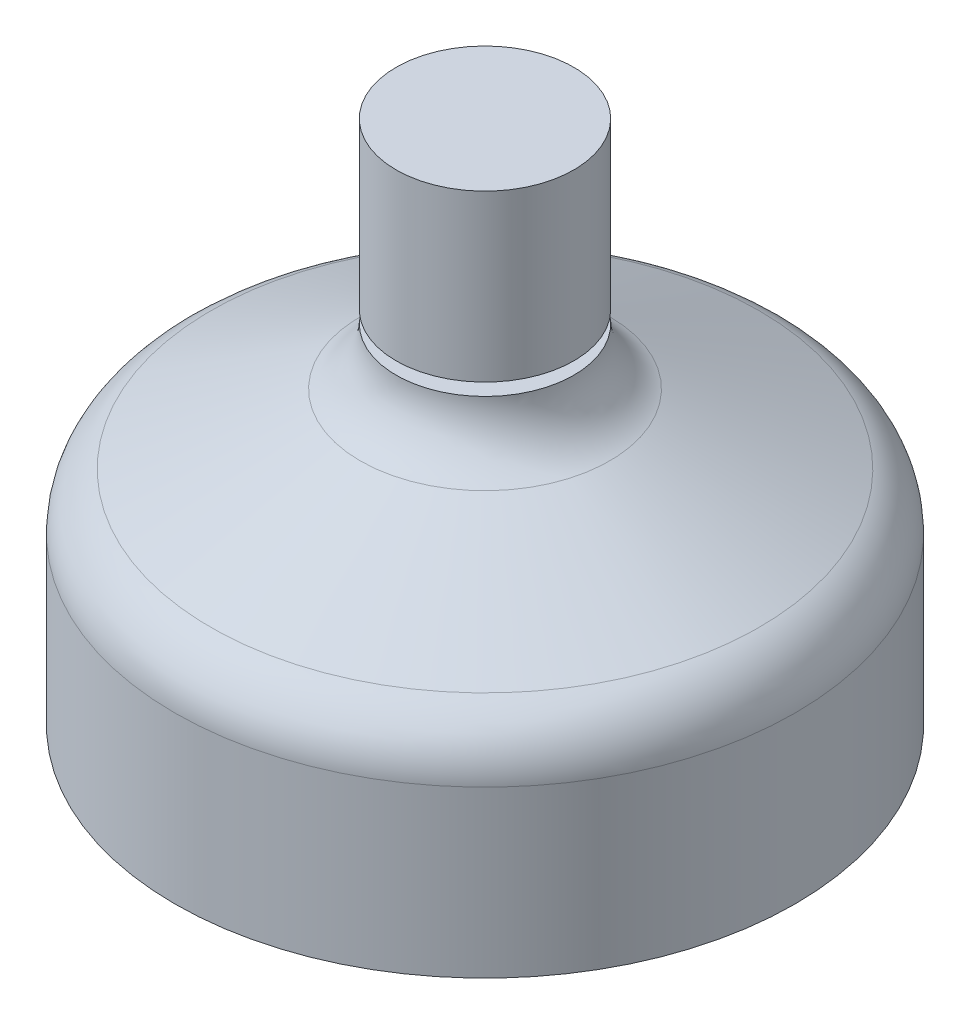
ISO-10303-21;
HEADER;
FILE_DESCRIPTION(('STEP AP214'),'2;1');
FILE_NAME('part.step','',(''),(''),'','','');
FILE_SCHEMA(('AUTOMOTIVE_DESIGN { 1 0 10303 214 1 1 1 1 }'));
ENDSEC;
DATA;
#1=APPLICATION_CONTEXT('core data for automotive mechanical design processes');
#2=APPLICATION_PROTOCOL_DEFINITION('international standard','automotive_design',2000,#1);
#3=PRODUCT_CONTEXT('',#1,'mechanical');
#4=PRODUCT('Part','Part','',(#3));
#5=PRODUCT_RELATED_PRODUCT_CATEGORY('part','',(#4));
#6=PRODUCT_DEFINITION_FORMATION('','',#4);
#7=PRODUCT_DEFINITION_CONTEXT('part definition',#1,'design');
#8=PRODUCT_DEFINITION('design','',#6,#7);
#9=PRODUCT_DEFINITION_SHAPE('','',#8);
#10=(LENGTH_UNIT() NAMED_UNIT(*) SI_UNIT(.MILLI.,.METRE.));
#11=(NAMED_UNIT(*) PLANE_ANGLE_UNIT() SI_UNIT($,.RADIAN.));
#12=(NAMED_UNIT(*) SI_UNIT($,.STERADIAN.) SOLID_ANGLE_UNIT());
#13=UNCERTAINTY_MEASURE_WITH_UNIT(LENGTH_MEASURE(1.E-05),#10,'distance_accuracy_value','');
#14=(GEOMETRIC_REPRESENTATION_CONTEXT(3) GLOBAL_UNCERTAINTY_ASSIGNED_CONTEXT((#13)) GLOBAL_UNIT_ASSIGNED_CONTEXT((#10,
#11,#12)) REPRESENTATION_CONTEXT('',''));
#15=CARTESIAN_POINT('',(0.,0.,0.));
#16=DIRECTION('',(0.,0.,1.));
#17=DIRECTION('',(1.,0.,0.));
#18=AXIS2_PLACEMENT_3D('',#15,#16,#17);
#19=CARTESIAN_POINT('',(0.,4.35,0.));
#20=DIRECTION('',(0.,1.,0.));
#21=DIRECTION('',(0.,0.,1.));
#22=AXIS2_PLACEMENT_3D('',#19,#20,#21);
#23=CYLINDRICAL_SURFACE('',#22,1.075);
#24=CARTESIAN_POINT('',(0.,4.35,0.));
#25=DIRECTION('',(0.,1.,0.));
#26=DIRECTION('',(0.,0.,1.));
#27=AXIS2_PLACEMENT_3D('',#24,#25,#26);
#28=CIRCLE('',#27,1.075);
#29=CARTESIAN_POINT('',(0.,4.35,1.075));
#30=VERTEX_POINT('',#29);
#31=EDGE_CURVE('E11',#30,#30,#28,.T.);
#32=ORIENTED_EDGE('',*,*,#31,.T.);
#33=EDGE_LOOP('',(#32));
#34=FACE_BOUND('',#33,.T.);
#35=CARTESIAN_POINT('',(0.,6.35,0.));
#36=DIRECTION('',(0.,1.,0.));
#37=DIRECTION('',(0.,0.,1.));
#38=AXIS2_PLACEMENT_3D('',#35,#36,#37);
#39=CIRCLE('',#38,1.075);
#40=CARTESIAN_POINT('',(0.,6.35,1.075));
#41=VERTEX_POINT('',#40);
#42=EDGE_CURVE('E50',#41,#41,#39,.T.);
#43=ORIENTED_EDGE('',*,*,#42,.F.);
#44=EDGE_LOOP('',(#43));
#45=FACE_BOUND('',#44,.T.);
#46=ADVANCED_FACE('F47',(#34,#45),#23,.T.);
#47=CARTESIAN_POINT('',(0.,4.35,0.));
#48=DIRECTION('',(0.,1.,0.));
#49=DIRECTION('',(0.,0.,1.));
#50=AXIS2_PLACEMENT_3D('',#47,#48,#49);
#51=PLANE('',#50);
#52=ORIENTED_EDGE('',*,*,#31,.F.);
#53=EDGE_LOOP('',(#52));
#54=FACE_BOUND('',#53,.T.);
#55=ADVANCED_FACE('F62',(#54),#51,.F.);
#56=CARTESIAN_POINT('',(0.,6.35,0.));
#57=DIRECTION('',(0.,1.,0.));
#58=DIRECTION('',(0.,0.,1.));
#59=AXIS2_PLACEMENT_3D('',#56,#57,#58);
#60=PLANE('',#59);
#61=ORIENTED_EDGE('',*,*,#42,.T.);
#62=EDGE_LOOP('',(#61));
#63=FACE_BOUND('',#62,.T.);
#64=ADVANCED_FACE('F59',(#63),#60,.T.);
#65=CLOSED_SHELL('',(#46,#55,#64));
#66=MANIFOLD_SOLID_BREP('B2',#65);
#67=CARTESIAN_POINT('',(0.,4.2,0.));
#68=DIRECTION('',(0.,-1.,0.));
#69=DIRECTION('',(0.,0.,-1.));
#70=AXIS2_PLACEMENT_3D('',#67,#68,#69);
#71=TOROIDAL_SURFACE('',#70,1.825,1.25);
#72=CARTESIAN_POINT('',(0.,4.2,0.));
#73=DIRECTION('',(0.,-1.,0.));
#74=DIRECTION('',(0.,0.,-1.));
#75=AXIS2_PLACEMENT_3D('',#72,#73,#74);
#76=CIRCLE('',#75,0.575);
#77=CARTESIAN_POINT('',(0.,4.2,-0.575));
#78=VERTEX_POINT('',#77);
#79=EDGE_CURVE('E46',#78,#78,#76,.T.);
#80=ORIENTED_EDGE('',*,*,#79,.F.);
#81=EDGE_LOOP('',(#80));
#82=FACE_BOUND('',#81,.T.);
#83=CARTESIAN_POINT('',(0.,3.06640104628178,0.));
#84=DIRECTION('',(0.,-1.,0.));
#85=DIRECTION('',(0.,0.,-1.));
#86=AXIS2_PLACEMENT_3D('',#83,#84,#85);
#87=CIRCLE('',#86,1.29826153346376);
#88=CARTESIAN_POINT('',(0.,3.06640104628178,-1.29826153346376));
#89=VERTEX_POINT('',#88);
#90=EDGE_CURVE('E128',#89,#89,#87,.T.);
#91=ORIENTED_EDGE('',*,*,#90,.T.);
#92=EDGE_LOOP('',(#91));
#93=FACE_BOUND('',#92,.T.);
#94=ADVANCED_FACE('F94',(#82,#93),#71,.T.);
#95=CARTESIAN_POINT('',(0.,4.2,1.075));
#96=DIRECTION('',(0.,1.,0.));
#97=DIRECTION('',(0.,0.,1.));
#98=AXIS2_PLACEMENT_3D('',#95,#96,#97);
#99=PLANE('',#98);
#100=ORIENTED_EDGE('',*,*,#79,.T.);
#101=EDGE_LOOP('',(#100));
#102=FACE_BOUND('',#101,.T.);
#103=CARTESIAN_POINT('',(0.,4.2,0.));
#104=DIRECTION('',(0.,-1.,0.));
#105=DIRECTION('',(0.,0.,-1.));
#106=AXIS2_PLACEMENT_3D('',#103,#104,#105);
#107=CIRCLE('',#106,1.075);
#108=CARTESIAN_POINT('',(0.,4.2,-1.075));
#109=VERTEX_POINT('',#108);
#110=EDGE_CURVE('E100',#109,#109,#107,.T.);
#111=ORIENTED_EDGE('',*,*,#110,.F.);
#112=EDGE_LOOP('',(#111));
#113=FACE_BOUND('',#112,.T.);
#114=ADVANCED_FACE('F163',(#102,#113),#99,.T.);
#115=CARTESIAN_POINT('',(0.,4.2,0.));
#116=DIRECTION('',(0.,-1.,0.));
#117=DIRECTION('',(0.,0.,-1.));
#118=AXIS2_PLACEMENT_3D('',#115,#116,#117);
#119=TOROIDAL_SURFACE('',#118,1.825,0.749999999999999);
#120=ORIENTED_EDGE('',*,*,#110,.T.);
#121=EDGE_LOOP('',(#120));
#122=FACE_BOUND('',#121,.T.);
#123=CARTESIAN_POINT('',(0.,3.51984062776907,0.));
#124=DIRECTION('',(0.,-1.,0.));
#125=DIRECTION('',(0.,0.,-1.));
#126=AXIS2_PLACEMENT_3D('',#123,#124,#125);
#127=CIRCLE('',#126,1.50895692007825);
#128=CARTESIAN_POINT('',(0.,3.51984062776907,-1.50895692007825));
#129=VERTEX_POINT('',#128);
#130=EDGE_CURVE('E104',#129,#129,#127,.T.);
#131=ORIENTED_EDGE('',*,*,#130,.F.);
#132=EDGE_LOOP('',(#131));
#133=FACE_BOUND('',#132,.T.);
#134=ADVANCED_FACE('F168',(#122,#133),#119,.F.);
#135=CARTESIAN_POINT('',(0.,2.68015937223093,0.));
#136=DIRECTION('',(0.,-1.,0.));
#137=DIRECTION('',(0.,0.,-1.));
#138=AXIS2_PLACEMENT_3D('',#135,#136,#137);
#139=CONICAL_SURFACE('',#138,3.31604307992175,1.13581797051234);
#140=ORIENTED_EDGE('',*,*,#130,.T.);
#141=EDGE_LOOP('',(#140));
#142=FACE_BOUND('',#141,.T.);
#143=CARTESIAN_POINT('',(0.,2.68015937223093,0.));
#144=DIRECTION('',(0.,-1.,0.));
#145=DIRECTION('',(0.,0.,-1.));
#146=AXIS2_PLACEMENT_3D('',#143,#144,#145);
#147=CIRCLE('',#146,3.31604307992175);
#148=CARTESIAN_POINT('',(0.,2.68015937223093,-3.31604307992175));
#149=VERTEX_POINT('',#148);
#150=EDGE_CURVE('E108',#149,#149,#147,.T.);
#151=ORIENTED_EDGE('',*,*,#150,.F.);
#152=EDGE_LOOP('',(#151));
#153=FACE_BOUND('',#152,.T.);
#154=ADVANCED_FACE('F172',(#142,#153),#139,.T.);
#155=CARTESIAN_POINT('',(0.,2.,0.));
#156=DIRECTION('',(0.,-1.,0.));
#157=DIRECTION('',(0.,0.,-1.));
#158=AXIS2_PLACEMENT_3D('',#155,#156,#157);
#159=TOROIDAL_SURFACE('',#158,3.,0.749999999999999);
#160=ORIENTED_EDGE('',*,*,#150,.T.);
#161=EDGE_LOOP('',(#160));
#162=FACE_BOUND('',#161,.T.);
#163=CARTESIAN_POINT('',(0.,2.,0.));
#164=DIRECTION('',(0.,-1.,0.));
#165=DIRECTION('',(0.,0.,-1.));
#166=AXIS2_PLACEMENT_3D('',#163,#164,#165);
#167=CIRCLE('',#166,3.75);
#168=CARTESIAN_POINT('',(0.,2.,-3.75));
#169=VERTEX_POINT('',#168);
#170=EDGE_CURVE('E113',#169,#169,#167,.T.);
#171=ORIENTED_EDGE('',*,*,#170,.F.);
#172=EDGE_LOOP('',(#171));
#173=FACE_BOUND('',#172,.T.);
#174=ADVANCED_FACE('F159',(#162,#173),#159,.T.);
#175=CARTESIAN_POINT('',(0.,-0.227579973653746,0.));
#176=DIRECTION('',(0.,-1.,0.));
#177=DIRECTION('',(0.,0.,-1.));
#178=AXIS2_PLACEMENT_3D('',#175,#176,#177);
#179=CYLINDRICAL_SURFACE('',#178,3.75);
#180=ORIENTED_EDGE('',*,*,#170,.T.);
#181=EDGE_LOOP('',(#180));
#182=FACE_BOUND('',#181,.T.);
#183=CARTESIAN_POINT('',(0.,0.,0.));
#184=DIRECTION('',(0.,-1.,0.));
#185=DIRECTION('',(0.,0.,-1.));
#186=AXIS2_PLACEMENT_3D('',#183,#184,#185);
#187=CIRCLE('',#186,3.75);
#188=CARTESIAN_POINT('',(0.,0.,-3.75));
#189=VERTEX_POINT('',#188);
#190=EDGE_CURVE('E116',#189,#189,#187,.T.);
#191=ORIENTED_EDGE('',*,*,#190,.F.);
#192=EDGE_LOOP('',(#191));
#193=FACE_BOUND('',#192,.T.);
#194=ADVANCED_FACE('F153',(#182,#193),#179,.T.);
#195=CARTESIAN_POINT('',(0.,0.,3.25));
#196=DIRECTION('',(0.,-1.,0.));
#197=DIRECTION('',(0.,0.,-1.));
#198=AXIS2_PLACEMENT_3D('',#195,#196,#197);
#199=PLANE('',#198);
#200=ORIENTED_EDGE('',*,*,#190,.T.);
#201=EDGE_LOOP('',(#200));
#202=FACE_BOUND('',#201,.T.);
#203=CARTESIAN_POINT('',(0.,0.,0.));
#204=DIRECTION('',(0.,-1.,0.));
#205=DIRECTION('',(0.,0.,-1.));
#206=AXIS2_PLACEMENT_3D('',#203,#204,#205);
#207=CIRCLE('',#206,3.25);
#208=CARTESIAN_POINT('',(0.,0.,-3.25));
#209=VERTEX_POINT('',#208);
#210=EDGE_CURVE('E119',#209,#209,#207,.T.);
#211=ORIENTED_EDGE('',*,*,#210,.F.);
#212=EDGE_LOOP('',(#211));
#213=FACE_BOUND('',#212,.T.);
#214=ADVANCED_FACE('F148',(#202,#213),#199,.T.);
#215=CARTESIAN_POINT('',(0.,-0.227579973653746,0.));
#216=DIRECTION('',(0.,-1.,0.));
#217=DIRECTION('',(0.,0.,-1.));
#218=AXIS2_PLACEMENT_3D('',#215,#216,#217);
#219=CYLINDRICAL_SURFACE('',#218,3.25);
#220=CARTESIAN_POINT('',(0.,2.,0.));
#221=DIRECTION('',(0.,-1.,0.));
#222=DIRECTION('',(0.,0.,-1.));
#223=AXIS2_PLACEMENT_3D('',#220,#221,#222);
#224=CIRCLE('',#223,3.25);
#225=CARTESIAN_POINT('',(0.,2.,-3.25));
#226=VERTEX_POINT('',#225);
#227=EDGE_CURVE('E122',#226,#226,#224,.T.);
#228=ORIENTED_EDGE('',*,*,#227,.F.);
#229=EDGE_LOOP('',(#228));
#230=FACE_BOUND('',#229,.T.);
#231=ORIENTED_EDGE('',*,*,#210,.T.);
#232=EDGE_LOOP('',(#231));
#233=FACE_BOUND('',#232,.T.);
#234=ADVANCED_FACE('F142',(#230,#233),#219,.F.);
#235=CARTESIAN_POINT('',(0.,2.,0.));
#236=DIRECTION('',(0.,-1.,0.));
#237=DIRECTION('',(0.,0.,-1.));
#238=AXIS2_PLACEMENT_3D('',#235,#236,#237);
#239=TOROIDAL_SURFACE('',#238,3.,0.249999999999999);
#240=CARTESIAN_POINT('',(0.,2.22671979074364,0.));
#241=DIRECTION('',(0.,-1.,0.));
#242=DIRECTION('',(0.,0.,-1.));
#243=AXIS2_PLACEMENT_3D('',#240,#241,#242);
#244=CIRCLE('',#243,3.10534769330725);
#245=CARTESIAN_POINT('',(0.,2.22671979074364,-3.10534769330725));
#246=VERTEX_POINT('',#245);
#247=EDGE_CURVE('E125',#246,#246,#244,.T.);
#248=ORIENTED_EDGE('',*,*,#247,.F.);
#249=EDGE_LOOP('',(#248));
#250=FACE_BOUND('',#249,.T.);
#251=ORIENTED_EDGE('',*,*,#227,.T.);
#252=EDGE_LOOP('',(#251));
#253=FACE_BOUND('',#252,.T.);
#254=ADVANCED_FACE('F136',(#250,#253),#239,.F.);
#255=CARTESIAN_POINT('',(0.,2.22671979074364,0.));
#256=DIRECTION('',(0.,-1.,0.));
#257=DIRECTION('',(0.,0.,-1.));
#258=AXIS2_PLACEMENT_3D('',#255,#256,#257);
#259=CONICAL_SURFACE('',#258,3.10534769330725,1.13581797051234);
#260=ORIENTED_EDGE('',*,*,#90,.F.);
#261=EDGE_LOOP('',(#260));
#262=FACE_BOUND('',#261,.T.);
#263=ORIENTED_EDGE('',*,*,#247,.T.);
#264=EDGE_LOOP('',(#263));
#265=FACE_BOUND('',#264,.T.);
#266=ADVANCED_FACE('F133',(#262,#265),#259,.F.);
#267=CLOSED_SHELL('',(#94,#114,#134,#154,#174,#194,#214,#234,#254,#266));
#268=MANIFOLD_SOLID_BREP('B6',#267);
#269=ADVANCED_BREP_SHAPE_REPRESENTATION('',(#18,#66,#268),#14);
#270=SHAPE_DEFINITION_REPRESENTATION(#9,#269);
ENDSEC;
END-ISO-10303-21;
